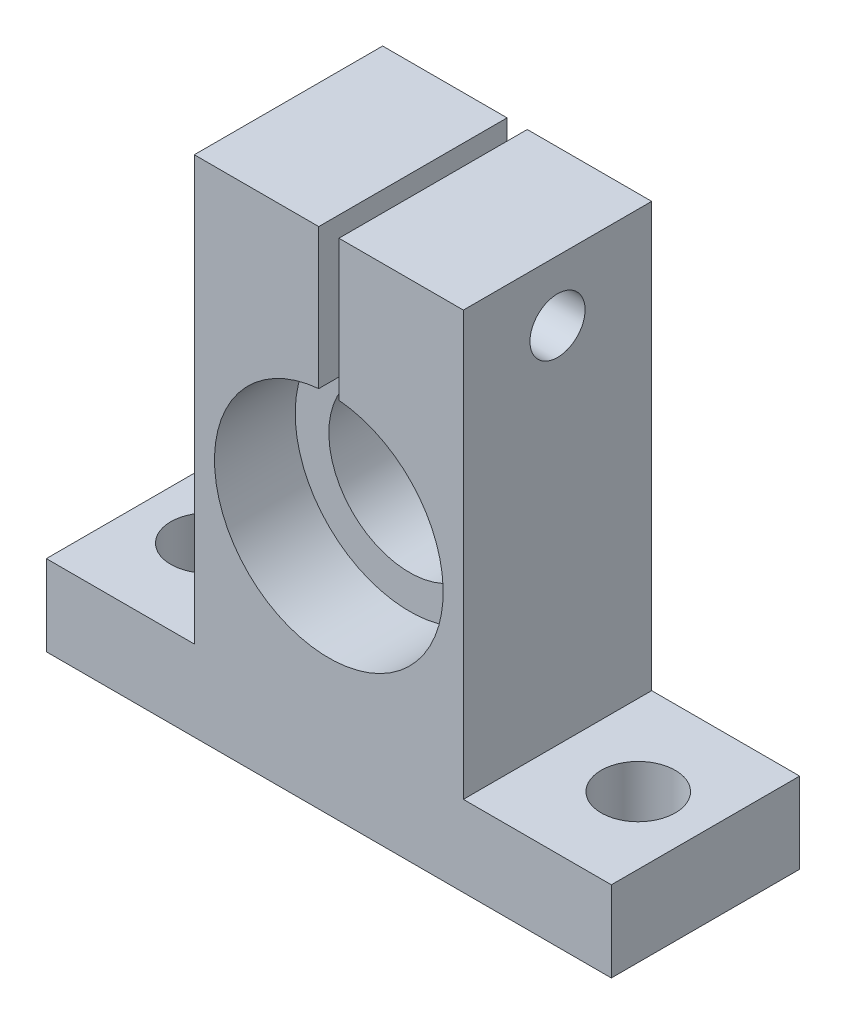
ISO-10303-21;
HEADER;
FILE_DESCRIPTION(('STEP AP214'),'2;1');
FILE_NAME('part.step','',(''),(''),'','','');
FILE_SCHEMA(('AUTOMOTIVE_DESIGN { 1 0 10303 214 1 1 1 1 }'));
ENDSEC;
DATA;
#1=APPLICATION_CONTEXT('core data for automotive mechanical design processes');
#2=APPLICATION_PROTOCOL_DEFINITION('international standard','automotive_design',2000,#1);
#3=PRODUCT_CONTEXT('',#1,'mechanical');
#4=PRODUCT('Part','Part','',(#3));
#5=PRODUCT_RELATED_PRODUCT_CATEGORY('part','',(#4));
#6=PRODUCT_DEFINITION_FORMATION('','',#4);
#7=PRODUCT_DEFINITION_CONTEXT('part definition',#1,'design');
#8=PRODUCT_DEFINITION('design','',#6,#7);
#9=PRODUCT_DEFINITION_SHAPE('','',#8);
#10=(LENGTH_UNIT() NAMED_UNIT(*) SI_UNIT(.MILLI.,.METRE.));
#11=(NAMED_UNIT(*) PLANE_ANGLE_UNIT() SI_UNIT($,.RADIAN.));
#12=(NAMED_UNIT(*) SI_UNIT($,.STERADIAN.) SOLID_ANGLE_UNIT());
#13=UNCERTAINTY_MEASURE_WITH_UNIT(LENGTH_MEASURE(1.E-05),#10,'distance_accuracy_value','');
#14=(GEOMETRIC_REPRESENTATION_CONTEXT(3) GLOBAL_UNCERTAINTY_ASSIGNED_CONTEXT((#13)) GLOBAL_UNIT_ASSIGNED_CONTEXT((#10,
#11,#12)) REPRESENTATION_CONTEXT('',''));
#15=CARTESIAN_POINT('',(0.,0.,0.));
#16=DIRECTION('',(0.,0.,1.));
#17=DIRECTION('',(1.,0.,0.));
#18=AXIS2_PLACEMENT_3D('',#15,#16,#17);
#19=CARTESIAN_POINT('',(0.,18.6,-7.));
#20=DIRECTION('',(0.,0.,1.));
#21=DIRECTION('',(1.,0.,0.));
#22=AXIS2_PLACEMENT_3D('',#19,#20,#21);
#23=CYLINDRICAL_SURFACE('',#22,6.);
#24=CARTESIAN_POINT('',(0.,18.6,1.));
#25=DIRECTION('',(0.,0.,1.));
#26=DIRECTION('',(1.,0.,0.));
#27=AXIS2_PLACEMENT_3D('',#24,#25,#26);
#28=CIRCLE('',#27,6.);
#29=CARTESIAN_POINT('',(0.749999999999944,24.5529404498953,1.));
#30=VERTEX_POINT('',#29);
#31=CARTESIAN_POINT('',(-0.750000000000056,24.5529404498953,1.));
#32=VERTEX_POINT('',#31);
#33=EDGE_CURVE('E262',#30,#32,#28,.F.);
#34=ORIENTED_EDGE('',*,*,#33,.F.);
#35=DIRECTION('',(0.,0.,1.));
#36=VECTOR('',#35,1.);
#37=CARTESIAN_POINT('',(0.749999999999944,24.5529404498953,-7.));
#38=LINE('',#37,#36);
#39=CARTESIAN_POINT('',(0.749999999999944,24.5529404498953,-7.));
#40=VERTEX_POINT('',#39);
#41=EDGE_CURVE('E58',#30,#40,#38,.F.);
#42=ORIENTED_EDGE('',*,*,#41,.T.);
#43=CARTESIAN_POINT('',(0.,18.6,-7.));
#44=DIRECTION('',(0.,0.,1.));
#45=DIRECTION('',(1.,0.,0.));
#46=AXIS2_PLACEMENT_3D('',#43,#44,#45);
#47=CIRCLE('',#46,6.);
#48=CARTESIAN_POINT('',(-0.750000000000056,24.5529404498953,-7.));
#49=VERTEX_POINT('',#48);
#50=EDGE_CURVE('E191',#49,#40,#47,.T.);
#51=ORIENTED_EDGE('',*,*,#50,.F.);
#52=DIRECTION('',(0.,0.,1.));
#53=VECTOR('',#52,1.);
#54=CARTESIAN_POINT('',(-0.750000000000056,24.5529404498953,-7.));
#55=LINE('',#54,#53);
#56=EDGE_CURVE('E164',#49,#32,#55,.T.);
#57=ORIENTED_EDGE('',*,*,#56,.T.);
#58=EDGE_LOOP('',(#34,#42,#51,#57));
#59=FACE_BOUND('',#58,.T.);
#60=ADVANCED_FACE('F35',(#59),#23,.F.);
#61=CARTESIAN_POINT('',(10.,37.5,7.));
#62=DIRECTION('',(0.,-1.,0.));
#63=DIRECTION('',(0.,0.,-1.));
#64=AXIS2_PLACEMENT_3D('',#61,#62,#63);
#65=PLANE('',#64);
#66=DIRECTION('',(-1.,0.,0.));
#67=VECTOR('',#66,1.);
#68=CARTESIAN_POINT('',(10.,37.5,-7.));
#69=LINE('',#68,#67);
#70=CARTESIAN_POINT('',(10.,37.5,-7.));
#71=VERTEX_POINT('',#70);
#72=CARTESIAN_POINT('',(0.749999999999897,37.5,-7.));
#73=VERTEX_POINT('',#72);
#74=EDGE_CURVE('E226',#71,#73,#69,.T.);
#75=ORIENTED_EDGE('',*,*,#74,.T.);
#76=DIRECTION('',(0.,0.,1.));
#77=VECTOR('',#76,1.);
#78=CARTESIAN_POINT('',(0.749999999999897,37.5,7.));
#79=LINE('',#78,#77);
#80=CARTESIAN_POINT('',(0.749999999999897,37.5,7.));
#81=VERTEX_POINT('',#80);
#82=EDGE_CURVE('E173',#73,#81,#79,.T.);
#83=ORIENTED_EDGE('',*,*,#82,.T.);
#84=DIRECTION('',(-1.,0.,0.));
#85=VECTOR('',#84,1.);
#86=CARTESIAN_POINT('',(10.,37.5,7.));
#87=LINE('',#86,#85);
#88=CARTESIAN_POINT('',(10.,37.5,7.));
#89=VERTEX_POINT('',#88);
#90=EDGE_CURVE('E154',#89,#81,#87,.T.);
#91=ORIENTED_EDGE('',*,*,#90,.F.);
#92=DIRECTION('',(0.,0.,-1.));
#93=VECTOR('',#92,1.);
#94=CARTESIAN_POINT('',(10.,37.5,7.));
#95=LINE('',#94,#93);
#96=EDGE_CURVE('E234',#89,#71,#95,.T.);
#97=ORIENTED_EDGE('',*,*,#96,.T.);
#98=EDGE_LOOP('',(#75,#83,#91,#97));
#99=FACE_BOUND('',#98,.T.);
#100=ADVANCED_FACE('F310',(#99),#65,.F.);
#101=CARTESIAN_POINT('',(-21.,33.,0.));
#102=DIRECTION('',(1.,0.,0.));
#103=DIRECTION('',(0.,0.,-1.));
#104=AXIS2_PLACEMENT_3D('',#101,#102,#103);
#105=CYLINDRICAL_SURFACE('',#104,2.05);
#106=CARTESIAN_POINT('',(0.749999999999914,33.,0.));
#107=DIRECTION('',(1.,0.,0.));
#108=DIRECTION('',(0.,1.,0.));
#109=AXIS2_PLACEMENT_3D('',#106,#107,#108);
#110=CIRCLE('',#109,2.05);
#111=CARTESIAN_POINT('',(0.749999999999906,35.05,0.));
#112=VERTEX_POINT('',#111);
#113=EDGE_CURVE('E171',#112,#112,#110,.F.);
#114=ORIENTED_EDGE('',*,*,#113,.T.);
#115=EDGE_LOOP('',(#114));
#116=FACE_BOUND('',#115,.T.);
#117=CARTESIAN_POINT('',(10.,33.,0.));
#118=DIRECTION('',(1.,0.,0.));
#119=DIRECTION('',(0.,0.,-1.));
#120=AXIS2_PLACEMENT_3D('',#117,#118,#119);
#121=CIRCLE('',#120,2.05);
#122=CARTESIAN_POINT('',(10.,33.,-2.05));
#123=VERTEX_POINT('',#122);
#124=EDGE_CURVE('E187',#123,#123,#121,.T.);
#125=ORIENTED_EDGE('',*,*,#124,.T.);
#126=EDGE_LOOP('',(#125));
#127=FACE_BOUND('',#126,.T.);
#128=ADVANCED_FACE('F329',(#116,#127),#105,.F.);
#129=CARTESIAN_POINT('',(0.,0.,7.));
#130=DIRECTION('',(0.,1.,0.));
#131=DIRECTION('',(0.,0.,1.));
#132=AXIS2_PLACEMENT_3D('',#129,#130,#131);
#133=PLANE('',#132);
#134=CARTESIAN_POINT('',(16.,0.,0.));
#135=DIRECTION('',(0.,1.,0.));
#136=DIRECTION('',(0.,0.,1.));
#137=AXIS2_PLACEMENT_3D('',#134,#135,#136);
#138=CIRCLE('',#137,2.75);
#139=CARTESIAN_POINT('',(16.,0.,2.75));
#140=VERTEX_POINT('',#139);
#141=EDGE_CURVE('E178',#140,#140,#138,.T.);
#142=ORIENTED_EDGE('',*,*,#141,.T.);
#143=EDGE_LOOP('',(#142));
#144=FACE_BOUND('',#143,.T.);
#145=CARTESIAN_POINT('',(-16.,0.,0.));
#146=DIRECTION('',(0.,1.,0.));
#147=DIRECTION('',(0.,0.,1.));
#148=AXIS2_PLACEMENT_3D('',#145,#146,#147);
#149=CIRCLE('',#148,2.75);
#150=CARTESIAN_POINT('',(-16.,0.,2.75));
#151=VERTEX_POINT('',#150);
#152=EDGE_CURVE('E184',#151,#151,#149,.T.);
#153=ORIENTED_EDGE('',*,*,#152,.T.);
#154=EDGE_LOOP('',(#153));
#155=FACE_BOUND('',#154,.T.);
#156=DIRECTION('',(1.,0.,0.));
#157=VECTOR('',#156,1.);
#158=CARTESIAN_POINT('',(0.,0.,-7.));
#159=LINE('',#158,#157);
#160=CARTESIAN_POINT('',(-21.,0.,-7.));
#161=VERTEX_POINT('',#160);
#162=CARTESIAN_POINT('',(21.,0.,-7.));
#163=VERTEX_POINT('',#162);
#164=EDGE_CURVE('E222',#161,#163,#159,.T.);
#165=ORIENTED_EDGE('',*,*,#164,.T.);
#166=DIRECTION('',(0.,0.,-1.));
#167=VECTOR('',#166,1.);
#168=CARTESIAN_POINT('',(21.,0.,7.));
#169=LINE('',#168,#167);
#170=CARTESIAN_POINT('',(21.,0.,7.));
#171=VERTEX_POINT('',#170);
#172=EDGE_CURVE('E253',#171,#163,#169,.T.);
#173=ORIENTED_EDGE('',*,*,#172,.F.);
#174=DIRECTION('',(1.,0.,0.));
#175=VECTOR('',#174,1.);
#176=CARTESIAN_POINT('',(0.,0.,7.));
#177=LINE('',#176,#175);
#178=CARTESIAN_POINT('',(-21.,0.,7.));
#179=VERTEX_POINT('',#178);
#180=EDGE_CURVE('E223',#179,#171,#177,.T.);
#181=ORIENTED_EDGE('',*,*,#180,.F.);
#182=DIRECTION('',(0.,0.,-1.));
#183=VECTOR('',#182,1.);
#184=CARTESIAN_POINT('',(-21.,0.,7.));
#185=LINE('',#184,#183);
#186=EDGE_CURVE('E205',#179,#161,#185,.T.);
#187=ORIENTED_EDGE('',*,*,#186,.T.);
#188=EDGE_LOOP('',(#165,#173,#181,#187));
#189=FACE_BOUND('',#188,.T.);
#190=ADVANCED_FACE('F37',(#144,#155,#189),#133,.F.);
#191=CARTESIAN_POINT('',(21.,0.,7.));
#192=DIRECTION('',(-1.,0.,0.));
#193=DIRECTION('',(0.,0.,1.));
#194=AXIS2_PLACEMENT_3D('',#191,#192,#193);
#195=PLANE('',#194);
#196=DIRECTION('',(0.,1.,0.));
#197=VECTOR('',#196,1.);
#198=CARTESIAN_POINT('',(21.,0.,-7.));
#199=LINE('',#198,#197);
#200=CARTESIAN_POINT('',(21.,6.,-7.));
#201=VERTEX_POINT('',#200);
#202=EDGE_CURVE('E236',#163,#201,#199,.T.);
#203=ORIENTED_EDGE('',*,*,#202,.T.);
#204=DIRECTION('',(0.,0.,-1.));
#205=VECTOR('',#204,1.);
#206=CARTESIAN_POINT('',(21.,6.,7.));
#207=LINE('',#206,#205);
#208=CARTESIAN_POINT('',(21.,6.,7.));
#209=VERTEX_POINT('',#208);
#210=EDGE_CURVE('E250',#209,#201,#207,.T.);
#211=ORIENTED_EDGE('',*,*,#210,.F.);
#212=DIRECTION('',(0.,1.,0.));
#213=VECTOR('',#212,1.);
#214=CARTESIAN_POINT('',(21.,0.,7.));
#215=LINE('',#214,#213);
#216=EDGE_CURVE('E225',#171,#209,#215,.T.);
#217=ORIENTED_EDGE('',*,*,#216,.F.);
#218=ORIENTED_EDGE('',*,*,#172,.T.);
#219=EDGE_LOOP('',(#203,#211,#217,#218));
#220=FACE_BOUND('',#219,.T.);
#221=ADVANCED_FACE('F298',(#220),#195,.F.);
#222=CARTESIAN_POINT('',(21.,6.,7.));
#223=DIRECTION('',(0.,-1.,0.));
#224=DIRECTION('',(1.,0.,0.));
#225=AXIS2_PLACEMENT_3D('',#222,#223,#224);
#226=PLANE('',#225);
#227=CARTESIAN_POINT('',(16.,6.,0.));
#228=DIRECTION('',(0.,1.,0.));
#229=DIRECTION('',(-1.,0.,0.));
#230=AXIS2_PLACEMENT_3D('',#227,#228,#229);
#231=CIRCLE('',#230,2.75);
#232=CARTESIAN_POINT('',(13.25,6.,0.));
#233=VERTEX_POINT('',#232);
#234=EDGE_CURVE('E175',#233,#233,#231,.T.);
#235=ORIENTED_EDGE('',*,*,#234,.F.);
#236=EDGE_LOOP('',(#235));
#237=FACE_BOUND('',#236,.T.);
#238=DIRECTION('',(-1.,0.,0.));
#239=VECTOR('',#238,1.);
#240=CARTESIAN_POINT('',(21.,6.,-7.));
#241=LINE('',#240,#239);
#242=CARTESIAN_POINT('',(10.,6.,-7.));
#243=VERTEX_POINT('',#242);
#244=EDGE_CURVE('E238',#201,#243,#241,.T.);
#245=ORIENTED_EDGE('',*,*,#244,.T.);
#246=DIRECTION('',(0.,0.,-1.));
#247=VECTOR('',#246,1.);
#248=CARTESIAN_POINT('',(10.,6.,7.));
#249=LINE('',#248,#247);
#250=CARTESIAN_POINT('',(10.,6.,7.));
#251=VERTEX_POINT('',#250);
#252=EDGE_CURVE('E247',#251,#243,#249,.T.);
#253=ORIENTED_EDGE('',*,*,#252,.F.);
#254=DIRECTION('',(-1.,0.,0.));
#255=VECTOR('',#254,1.);
#256=CARTESIAN_POINT('',(21.,6.,7.));
#257=LINE('',#256,#255);
#258=EDGE_CURVE('E228',#209,#251,#257,.T.);
#259=ORIENTED_EDGE('',*,*,#258,.F.);
#260=ORIENTED_EDGE('',*,*,#210,.T.);
#261=EDGE_LOOP('',(#245,#253,#259,#260));
#262=FACE_BOUND('',#261,.T.);
#263=ADVANCED_FACE('F303',(#237,#262),#226,.F.);
#264=CARTESIAN_POINT('',(10.,6.,7.));
#265=DIRECTION('',(-1.,0.,0.));
#266=DIRECTION('',(0.,0.,1.));
#267=AXIS2_PLACEMENT_3D('',#264,#265,#266);
#268=PLANE('',#267);
#269=ORIENTED_EDGE('',*,*,#124,.F.);
#270=EDGE_LOOP('',(#269));
#271=FACE_BOUND('',#270,.T.);
#272=DIRECTION('',(0.,1.,0.));
#273=VECTOR('',#272,1.);
#274=CARTESIAN_POINT('',(10.,6.,-7.));
#275=LINE('',#274,#273);
#276=EDGE_CURVE('E240',#243,#71,#275,.T.);
#277=ORIENTED_EDGE('',*,*,#276,.T.);
#278=ORIENTED_EDGE('',*,*,#96,.F.);
#279=DIRECTION('',(0.,1.,0.));
#280=VECTOR('',#279,1.);
#281=CARTESIAN_POINT('',(10.,6.,7.));
#282=LINE('',#281,#280);
#283=EDGE_CURVE('E230',#251,#89,#282,.T.);
#284=ORIENTED_EDGE('',*,*,#283,.F.);
#285=ORIENTED_EDGE('',*,*,#252,.T.);
#286=EDGE_LOOP('',(#277,#278,#284,#285));
#287=FACE_BOUND('',#286,.T.);
#288=ADVANCED_FACE('F307',(#271,#287),#268,.F.);
#289=CARTESIAN_POINT('',(-0.750000000000103,37.5,7.));
#290=VERTEX_POINT('',#289);
#291=CARTESIAN_POINT('',(-10.,37.5,7.));
#292=VERTEX_POINT('',#291);
#293=EDGE_CURVE('E232',#290,#292,#87,.T.);
#294=ORIENTED_EDGE('',*,*,#293,.F.);
#295=DIRECTION('',(0.,0.,-1.));
#296=VECTOR('',#295,1.);
#297=CARTESIAN_POINT('',(-0.750000000000103,37.5,7.));
#298=LINE('',#297,#296);
#299=CARTESIAN_POINT('',(-0.750000000000103,37.5,-7.));
#300=VERTEX_POINT('',#299);
#301=EDGE_CURVE('E167',#290,#300,#298,.T.);
#302=ORIENTED_EDGE('',*,*,#301,.T.);
#303=CARTESIAN_POINT('',(-10.,37.5,-7.));
#304=VERTEX_POINT('',#303);
#305=EDGE_CURVE('E242',#300,#304,#69,.T.);
#306=ORIENTED_EDGE('',*,*,#305,.T.);
#307=DIRECTION('',(0.,0.,-1.));
#308=VECTOR('',#307,1.);
#309=CARTESIAN_POINT('',(-10.,37.5,7.));
#310=LINE('',#309,#308);
#311=EDGE_CURVE('E219',#292,#304,#310,.T.);
#312=ORIENTED_EDGE('',*,*,#311,.F.);
#313=EDGE_LOOP('',(#294,#302,#306,#312));
#314=FACE_BOUND('',#313,.T.);
#315=ADVANCED_FACE('F275',(#314),#65,.F.);
#316=CARTESIAN_POINT('',(0.,0.,7.));
#317=DIRECTION('',(0.,0.,1.));
#318=DIRECTION('',(1.,0.,0.));
#319=AXIS2_PLACEMENT_3D('',#316,#317,#318);
#320=PLANE('',#319);
#321=CARTESIAN_POINT('',(0.,18.6,7.));
#322=DIRECTION('',(0.,0.,1.));
#323=DIRECTION('',(1.,0.,0.));
#324=AXIS2_PLACEMENT_3D('',#321,#322,#323);
#325=CIRCLE('',#324,8.5);
#326=CARTESIAN_POINT('',(-0.750000000000065,27.066847110938,7.));
#327=VERTEX_POINT('',#326);
#328=CARTESIAN_POINT('',(0.749999999999935,27.0668471109381,7.));
#329=VERTEX_POINT('',#328);
#330=EDGE_CURVE('E137',#327,#329,#325,.T.);
#331=ORIENTED_EDGE('',*,*,#330,.F.);
#332=DIRECTION('',(0.,-1.,0.));
#333=VECTOR('',#332,1.);
#334=CARTESIAN_POINT('',(-0.750000000000157,52.,7.));
#335=LINE('',#334,#333);
#336=EDGE_CURVE('E156',#290,#327,#335,.T.);
#337=ORIENTED_EDGE('',*,*,#336,.F.);
#338=ORIENTED_EDGE('',*,*,#293,.T.);
#339=DIRECTION('',(0.,1.,0.));
#340=VECTOR('',#339,1.);
#341=CARTESIAN_POINT('',(-10.,6.,7.));
#342=LINE('',#341,#340);
#343=CARTESIAN_POINT('',(-10.,6.,7.));
#344=VERTEX_POINT('',#343);
#345=EDGE_CURVE('E195',#344,#292,#342,.T.);
#346=ORIENTED_EDGE('',*,*,#345,.F.);
#347=DIRECTION('',(1.,0.,0.));
#348=VECTOR('',#347,1.);
#349=CARTESIAN_POINT('',(-21.,6.,7.));
#350=LINE('',#349,#348);
#351=CARTESIAN_POINT('',(-21.,6.,7.));
#352=VERTEX_POINT('',#351);
#353=EDGE_CURVE('E198',#352,#344,#350,.T.);
#354=ORIENTED_EDGE('',*,*,#353,.F.);
#355=DIRECTION('',(0.,1.,0.));
#356=VECTOR('',#355,1.);
#357=CARTESIAN_POINT('',(-21.,0.,7.));
#358=LINE('',#357,#356);
#359=EDGE_CURVE('E202',#179,#352,#358,.T.);
#360=ORIENTED_EDGE('',*,*,#359,.F.);
#361=ORIENTED_EDGE('',*,*,#180,.T.);
#362=ORIENTED_EDGE('',*,*,#216,.T.);
#363=ORIENTED_EDGE('',*,*,#258,.T.);
#364=ORIENTED_EDGE('',*,*,#283,.T.);
#365=ORIENTED_EDGE('',*,*,#90,.T.);
#366=DIRECTION('',(0.,1.,0.));
#367=VECTOR('',#366,1.);
#368=CARTESIAN_POINT('',(0.749999999999843,52.,7.));
#369=LINE('',#368,#367);
#370=EDGE_CURVE('E149',#329,#81,#369,.T.);
#371=ORIENTED_EDGE('',*,*,#370,.F.);
#372=EDGE_LOOP('',(#331,#337,#338,#346,#354,#360,#361,#362,#363,#364,#365,#371));
#373=FACE_BOUND('',#372,.T.);
#374=ADVANCED_FACE('F152',(#373),#320,.T.);
#375=CARTESIAN_POINT('',(0.,0.,-7.));
#376=DIRECTION('',(0.,0.,1.));
#377=DIRECTION('',(1.,0.,0.));
#378=AXIS2_PLACEMENT_3D('',#375,#376,#377);
#379=PLANE('',#378);
#380=ORIENTED_EDGE('',*,*,#50,.T.);
#381=DIRECTION('',(0.,1.,0.));
#382=VECTOR('',#381,1.);
#383=CARTESIAN_POINT('',(0.749999999999843,52.,-7.));
#384=LINE('',#383,#382);
#385=EDGE_CURVE('E159',#40,#73,#384,.T.);
#386=ORIENTED_EDGE('',*,*,#385,.T.);
#387=ORIENTED_EDGE('',*,*,#74,.F.);
#388=ORIENTED_EDGE('',*,*,#276,.F.);
#389=ORIENTED_EDGE('',*,*,#244,.F.);
#390=ORIENTED_EDGE('',*,*,#202,.F.);
#391=ORIENTED_EDGE('',*,*,#164,.F.);
#392=DIRECTION('',(0.,1.,0.));
#393=VECTOR('',#392,1.);
#394=CARTESIAN_POINT('',(-21.,0.,-7.));
#395=LINE('',#394,#393);
#396=CARTESIAN_POINT('',(-21.,6.,-7.));
#397=VERTEX_POINT('',#396);
#398=EDGE_CURVE('E199',#161,#397,#395,.T.);
#399=ORIENTED_EDGE('',*,*,#398,.T.);
#400=DIRECTION('',(1.,0.,0.));
#401=VECTOR('',#400,1.);
#402=CARTESIAN_POINT('',(-21.,6.,-7.));
#403=LINE('',#402,#401);
#404=CARTESIAN_POINT('',(-10.,6.,-7.));
#405=VERTEX_POINT('',#404);
#406=EDGE_CURVE('E208',#397,#405,#403,.T.);
#407=ORIENTED_EDGE('',*,*,#406,.T.);
#408=DIRECTION('',(0.,1.,0.));
#409=VECTOR('',#408,1.);
#410=CARTESIAN_POINT('',(-10.,6.,-7.));
#411=LINE('',#410,#409);
#412=EDGE_CURVE('E194',#405,#304,#411,.T.);
#413=ORIENTED_EDGE('',*,*,#412,.T.);
#414=ORIENTED_EDGE('',*,*,#305,.F.);
#415=DIRECTION('',(0.,-1.,0.));
#416=VECTOR('',#415,1.);
#417=CARTESIAN_POINT('',(-0.750000000000157,52.,-7.));
#418=LINE('',#417,#416);
#419=EDGE_CURVE('E155',#300,#49,#418,.T.);
#420=ORIENTED_EDGE('',*,*,#419,.T.);
#421=EDGE_LOOP('',(#380,#386,#387,#388,#389,#390,#391,#399,#407,#413,#414,#420));
#422=FACE_BOUND('',#421,.T.);
#423=ADVANCED_FACE('F269',(#422),#379,.F.);
#424=CARTESIAN_POINT('',(-10.,6.,7.));
#425=DIRECTION('',(-1.,0.,0.));
#426=DIRECTION('',(0.,0.,1.));
#427=AXIS2_PLACEMENT_3D('',#424,#425,#426);
#428=PLANE('',#427);
#429=CARTESIAN_POINT('',(-10.,33.,0.));
#430=DIRECTION('',(-1.,0.,0.));
#431=DIRECTION('',(0.,0.,1.));
#432=AXIS2_PLACEMENT_3D('',#429,#430,#431);
#433=CIRCLE('',#432,2.05);
#434=CARTESIAN_POINT('',(-10.,33.,2.05));
#435=VERTEX_POINT('',#434);
#436=EDGE_CURVE('E190',#435,#435,#433,.T.);
#437=ORIENTED_EDGE('',*,*,#436,.F.);
#438=EDGE_LOOP('',(#437));
#439=FACE_BOUND('',#438,.T.);
#440=ORIENTED_EDGE('',*,*,#412,.F.);
#441=DIRECTION('',(0.,0.,-1.));
#442=VECTOR('',#441,1.);
#443=CARTESIAN_POINT('',(-10.,6.,7.));
#444=LINE('',#443,#442);
#445=EDGE_CURVE('E217',#344,#405,#444,.T.);
#446=ORIENTED_EDGE('',*,*,#445,.F.);
#447=ORIENTED_EDGE('',*,*,#345,.T.);
#448=ORIENTED_EDGE('',*,*,#311,.T.);
#449=EDGE_LOOP('',(#440,#446,#447,#448));
#450=FACE_BOUND('',#449,.T.);
#451=ADVANCED_FACE('F311',(#439,#450),#428,.T.);
#452=CARTESIAN_POINT('',(-21.,6.,7.));
#453=DIRECTION('',(0.,1.,0.));
#454=DIRECTION('',(-1.,0.,0.));
#455=AXIS2_PLACEMENT_3D('',#452,#453,#454);
#456=PLANE('',#455);
#457=CARTESIAN_POINT('',(-16.,5.99999999999999,0.));
#458=DIRECTION('',(0.,1.,0.));
#459=DIRECTION('',(-1.,0.,0.));
#460=AXIS2_PLACEMENT_3D('',#457,#458,#459);
#461=CIRCLE('',#460,2.75);
#462=CARTESIAN_POINT('',(-18.75,5.99999999999999,0.));
#463=VERTEX_POINT('',#462);
#464=EDGE_CURVE('E181',#463,#463,#461,.T.);
#465=ORIENTED_EDGE('',*,*,#464,.F.);
#466=EDGE_LOOP('',(#465));
#467=FACE_BOUND('',#466,.T.);
#468=ORIENTED_EDGE('',*,*,#406,.F.);
#469=DIRECTION('',(0.,0.,-1.));
#470=VECTOR('',#469,1.);
#471=CARTESIAN_POINT('',(-21.,6.,7.));
#472=LINE('',#471,#470);
#473=EDGE_CURVE('E215',#352,#397,#472,.T.);
#474=ORIENTED_EDGE('',*,*,#473,.F.);
#475=ORIENTED_EDGE('',*,*,#353,.T.);
#476=ORIENTED_EDGE('',*,*,#445,.T.);
#477=EDGE_LOOP('',(#468,#474,#475,#476));
#478=FACE_BOUND('',#477,.T.);
#479=ADVANCED_FACE('F286',(#467,#478),#456,.T.);
#480=CARTESIAN_POINT('',(-21.,0.,7.));
#481=DIRECTION('',(-1.,0.,0.));
#482=DIRECTION('',(0.,0.,1.));
#483=AXIS2_PLACEMENT_3D('',#480,#481,#482);
#484=PLANE('',#483);
#485=ORIENTED_EDGE('',*,*,#398,.F.);
#486=ORIENTED_EDGE('',*,*,#186,.F.);
#487=ORIENTED_EDGE('',*,*,#359,.T.);
#488=ORIENTED_EDGE('',*,*,#473,.T.);
#489=EDGE_LOOP('',(#485,#486,#487,#488));
#490=FACE_BOUND('',#489,.T.);
#491=ADVANCED_FACE('F290',(#490),#484,.T.);
#492=CARTESIAN_POINT('',(-0.750000000000087,33.,0.));
#493=DIRECTION('',(-1.,0.,0.));
#494=DIRECTION('',(0.,-1.,0.));
#495=AXIS2_PLACEMENT_3D('',#492,#493,#494);
#496=CIRCLE('',#495,2.05);
#497=CARTESIAN_POINT('',(-0.75000000000008,30.95,0.));
#498=VERTEX_POINT('',#497);
#499=EDGE_CURVE('E168',#498,#498,#496,.F.);
#500=ORIENTED_EDGE('',*,*,#499,.T.);
#501=EDGE_LOOP('',(#500));
#502=FACE_BOUND('',#501,.T.);
#503=ORIENTED_EDGE('',*,*,#436,.T.);
#504=EDGE_LOOP('',(#503));
#505=FACE_BOUND('',#504,.T.);
#506=ADVANCED_FACE('F333',(#502,#505),#105,.F.);
#507=CARTESIAN_POINT('',(-16.,-8.00000000000001,0.));
#508=DIRECTION('',(0.,1.,0.));
#509=DIRECTION('',(-1.,0.,0.));
#510=AXIS2_PLACEMENT_3D('',#507,#508,#509);
#511=CYLINDRICAL_SURFACE('',#510,2.75);
#512=ORIENTED_EDGE('',*,*,#464,.T.);
#513=EDGE_LOOP('',(#512));
#514=FACE_BOUND('',#513,.T.);
#515=ORIENTED_EDGE('',*,*,#152,.F.);
#516=EDGE_LOOP('',(#515));
#517=FACE_BOUND('',#516,.T.);
#518=ADVANCED_FACE('F339',(#514,#517),#511,.F.);
#519=CARTESIAN_POINT('',(16.,-8.,0.));
#520=DIRECTION('',(0.,1.,0.));
#521=DIRECTION('',(-1.,0.,0.));
#522=AXIS2_PLACEMENT_3D('',#519,#520,#521);
#523=CYLINDRICAL_SURFACE('',#522,2.75);
#524=ORIENTED_EDGE('',*,*,#234,.T.);
#525=EDGE_LOOP('',(#524));
#526=FACE_BOUND('',#525,.T.);
#527=ORIENTED_EDGE('',*,*,#141,.F.);
#528=EDGE_LOOP('',(#527));
#529=FACE_BOUND('',#528,.T.);
#530=ADVANCED_FACE('F344',(#526,#529),#523,.F.);
#531=CARTESIAN_POINT('',(-0.750000000000157,52.,-7.));
#532=DIRECTION('',(-1.,0.,0.));
#533=DIRECTION('',(0.,-1.,0.));
#534=AXIS2_PLACEMENT_3D('',#531,#532,#533);
#535=PLANE('',#534);
#536=ORIENTED_EDGE('',*,*,#499,.F.);
#537=EDGE_LOOP('',(#536));
#538=FACE_BOUND('',#537,.T.);
#539=ORIENTED_EDGE('',*,*,#336,.T.);
#540=DIRECTION('',(0.,0.,1.));
#541=VECTOR('',#540,1.);
#542=CARTESIAN_POINT('',(-0.750000000000065,27.066847110938,1.));
#543=LINE('',#542,#541);
#544=CARTESIAN_POINT('',(-0.750000000000065,27.066847110938,1.));
#545=VERTEX_POINT('',#544);
#546=EDGE_CURVE('E141',#327,#545,#543,.F.);
#547=ORIENTED_EDGE('',*,*,#546,.T.);
#548=DIRECTION('',(0.,1.,0.));
#549=VECTOR('',#548,1.);
#550=CARTESIAN_POINT('',(-0.750000000000157,52.,1.));
#551=LINE('',#550,#549);
#552=EDGE_CURVE('E264',#32,#545,#551,.T.);
#553=ORIENTED_EDGE('',*,*,#552,.F.);
#554=ORIENTED_EDGE('',*,*,#56,.F.);
#555=ORIENTED_EDGE('',*,*,#419,.F.);
#556=ORIENTED_EDGE('',*,*,#301,.F.);
#557=EDGE_LOOP('',(#539,#547,#553,#554,#555,#556));
#558=FACE_BOUND('',#557,.T.);
#559=ADVANCED_FACE('F272',(#538,#558),#535,.F.);
#560=CARTESIAN_POINT('',(0.749999999999843,52.,-7.));
#561=DIRECTION('',(1.,0.,0.));
#562=DIRECTION('',(0.,1.,0.));
#563=AXIS2_PLACEMENT_3D('',#560,#561,#562);
#564=PLANE('',#563);
#565=ORIENTED_EDGE('',*,*,#113,.F.);
#566=EDGE_LOOP('',(#565));
#567=FACE_BOUND('',#566,.T.);
#568=DIRECTION('',(0.,-1.,0.));
#569=VECTOR('',#568,1.);
#570=CARTESIAN_POINT('',(0.749999999999843,52.,1.));
#571=LINE('',#570,#569);
#572=CARTESIAN_POINT('',(0.749999999999935,27.0668471109381,1.));
#573=VERTEX_POINT('',#572);
#574=EDGE_CURVE('E43',#573,#30,#571,.T.);
#575=ORIENTED_EDGE('',*,*,#574,.F.);
#576=DIRECTION('',(0.,0.,1.));
#577=VECTOR('',#576,1.);
#578=CARTESIAN_POINT('',(0.749999999999935,27.0668471109381,1.));
#579=LINE('',#578,#577);
#580=EDGE_CURVE('E11',#573,#329,#579,.T.);
#581=ORIENTED_EDGE('',*,*,#580,.T.);
#582=ORIENTED_EDGE('',*,*,#370,.T.);
#583=ORIENTED_EDGE('',*,*,#82,.F.);
#584=ORIENTED_EDGE('',*,*,#385,.F.);
#585=ORIENTED_EDGE('',*,*,#41,.F.);
#586=EDGE_LOOP('',(#575,#581,#582,#583,#584,#585));
#587=FACE_BOUND('',#586,.T.);
#588=ADVANCED_FACE('F148',(#567,#587),#564,.F.);
#589=CARTESIAN_POINT('',(0.,18.6,1.));
#590=DIRECTION('',(0.,0.,1.));
#591=DIRECTION('',(1.,0.,0.));
#592=AXIS2_PLACEMENT_3D('',#589,#590,#591);
#593=CYLINDRICAL_SURFACE('',#592,8.5);
#594=ORIENTED_EDGE('',*,*,#330,.T.);
#595=ORIENTED_EDGE('',*,*,#580,.F.);
#596=CARTESIAN_POINT('',(0.,18.6,1.));
#597=DIRECTION('',(0.,0.,1.));
#598=DIRECTION('',(1.,0.,0.));
#599=AXIS2_PLACEMENT_3D('',#596,#597,#598);
#600=CIRCLE('',#599,8.5);
#601=EDGE_CURVE('E50',#545,#573,#600,.T.);
#602=ORIENTED_EDGE('',*,*,#601,.F.);
#603=ORIENTED_EDGE('',*,*,#546,.F.);
#604=EDGE_LOOP('',(#594,#595,#602,#603));
#605=FACE_BOUND('',#604,.T.);
#606=ADVANCED_FACE('F138',(#605),#593,.F.);
#607=CARTESIAN_POINT('',(0.,18.6,1.));
#608=DIRECTION('',(0.,0.,1.));
#609=DIRECTION('',(1.,0.,0.));
#610=AXIS2_PLACEMENT_3D('',#607,#608,#609);
#611=PLANE('',#610);
#612=ORIENTED_EDGE('',*,*,#552,.T.);
#613=ORIENTED_EDGE('',*,*,#601,.T.);
#614=ORIENTED_EDGE('',*,*,#574,.T.);
#615=ORIENTED_EDGE('',*,*,#33,.T.);
#616=EDGE_LOOP('',(#612,#613,#614,#615));
#617=FACE_BOUND('',#616,.T.);
#618=ADVANCED_FACE('F261',(#617),#611,.T.);
#619=CLOSED_SHELL('',(#60,#100,#128,#190,#221,#263,#288,#315,#374,#423,#451,#479,#491,#506,#518,
#530,#559,#588,#606,#618));
#620=MANIFOLD_SOLID_BREP('B2',#619);
#621=ADVANCED_BREP_SHAPE_REPRESENTATION('',(#18,#620),#14);
#622=SHAPE_DEFINITION_REPRESENTATION(#9,#621);
ENDSEC;
END-ISO-10303-21;
